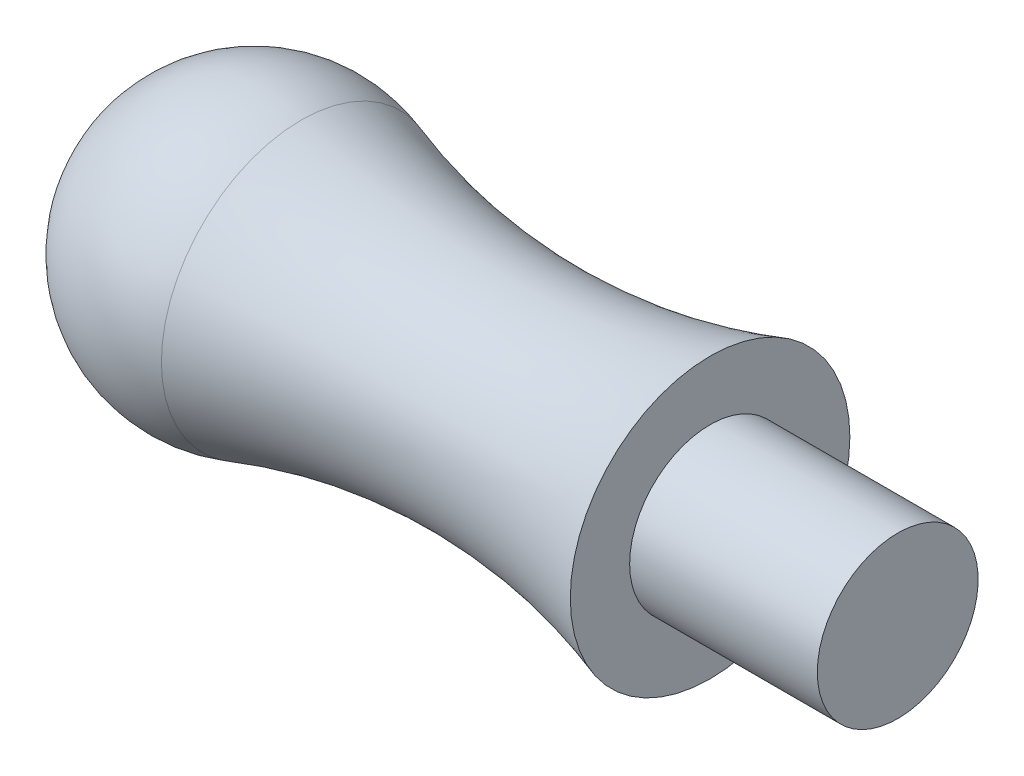
ISO-10303-21;
HEADER;
FILE_DESCRIPTION(('STEP AP214'),'2;1');
FILE_NAME('part.step','',(''),(''),'','','');
FILE_SCHEMA(('AUTOMOTIVE_DESIGN { 1 0 10303 214 1 1 1 1 }'));
ENDSEC;
DATA;
#1=APPLICATION_CONTEXT('core data for automotive mechanical design processes');
#2=APPLICATION_PROTOCOL_DEFINITION('international standard','automotive_design',2000,#1);
#3=PRODUCT_CONTEXT('',#1,'mechanical');
#4=PRODUCT('Part','Part','',(#3));
#5=PRODUCT_RELATED_PRODUCT_CATEGORY('part','',(#4));
#6=PRODUCT_DEFINITION_FORMATION('','',#4);
#7=PRODUCT_DEFINITION_CONTEXT('part definition',#1,'design');
#8=PRODUCT_DEFINITION('design','',#6,#7);
#9=PRODUCT_DEFINITION_SHAPE('','',#8);
#10=(LENGTH_UNIT() NAMED_UNIT(*) SI_UNIT(.MILLI.,.METRE.));
#11=(NAMED_UNIT(*) PLANE_ANGLE_UNIT() SI_UNIT($,.RADIAN.));
#12=(NAMED_UNIT(*) SI_UNIT($,.STERADIAN.) SOLID_ANGLE_UNIT());
#13=UNCERTAINTY_MEASURE_WITH_UNIT(LENGTH_MEASURE(1.E-05),#10,'distance_accuracy_value','');
#14=(GEOMETRIC_REPRESENTATION_CONTEXT(3) GLOBAL_UNCERTAINTY_ASSIGNED_CONTEXT((#13)) GLOBAL_UNIT_ASSIGNED_CONTEXT((#10,
#11,#12)) REPRESENTATION_CONTEXT('',''));
#15=CARTESIAN_POINT('',(0.,0.,0.));
#16=DIRECTION('',(0.,0.,1.));
#17=DIRECTION('',(1.,0.,0.));
#18=AXIS2_PLACEMENT_3D('',#15,#16,#17);
#19=CARTESIAN_POINT('',(0.,0.,0.));
#20=DIRECTION('',(-1.,0.,0.));
#21=DIRECTION('',(0.,1.,0.));
#22=AXIS2_PLACEMENT_3D('',#19,#20,#21);
#23=SPHERICAL_SURFACE('',#22,5.5);
#24=CARTESIAN_POINT('',(1.74766355140187,0.,0.));
#25=DIRECTION('',(-1.,0.,0.));
#26=DIRECTION('',(0.,0.,1.));
#27=AXIS2_PLACEMENT_3D('',#24,#25,#26);
#28=CIRCLE('',#27,5.21494699024845);
#29=CARTESIAN_POINT('',(1.74766355140187,0.,5.21494699024845));
#30=VERTEX_POINT('',#29);
#31=EDGE_CURVE('E48',#30,#30,#28,.T.);
#32=ORIENTED_EDGE('',*,*,#31,.T.);
#33=EDGE_LOOP('',(#32));
#34=FACE_BOUND('',#33,.T.);
#35=ADVANCED_FACE('F34',(#34),#23,.T.);
#36=CARTESIAN_POINT('',(24.,0.,0.));
#37=DIRECTION('',(-1.,0.,0.));
#38=DIRECTION('',(0.,0.,1.));
#39=AXIS2_PLACEMENT_3D('',#36,#37,#38);
#40=PLANE('',#39);
#41=CARTESIAN_POINT('',(24.,0.,0.));
#42=DIRECTION('',(-1.,0.,0.));
#43=DIRECTION('',(0.,0.,1.));
#44=AXIS2_PLACEMENT_3D('',#41,#42,#43);
#45=CIRCLE('',#44,3.);
#46=CARTESIAN_POINT('',(24.,0.,3.));
#47=VERTEX_POINT('',#46);
#48=EDGE_CURVE('E10',#47,#47,#45,.T.);
#49=ORIENTED_EDGE('',*,*,#48,.F.);
#50=EDGE_LOOP('',(#49));
#51=FACE_BOUND('',#50,.T.);
#52=ADVANCED_FACE('F68',(#51),#40,.F.);
#53=CARTESIAN_POINT('',(0.,0.,0.));
#54=DIRECTION('',(-1.,0.,0.));
#55=DIRECTION('',(0.,0.,1.));
#56=AXIS2_PLACEMENT_3D('',#53,#54,#55);
#57=CYLINDRICAL_SURFACE('',#56,3.);
#58=CARTESIAN_POINT('',(17.,0.,0.));
#59=DIRECTION('',(-1.,0.,0.));
#60=DIRECTION('',(0.,0.,1.));
#61=AXIS2_PLACEMENT_3D('',#58,#59,#60);
#62=CIRCLE('',#61,3.);
#63=CARTESIAN_POINT('',(17.,0.,3.));
#64=VERTEX_POINT('',#63);
#65=EDGE_CURVE('E40',#64,#64,#62,.T.);
#66=ORIENTED_EDGE('',*,*,#65,.F.);
#67=EDGE_LOOP('',(#66));
#68=FACE_BOUND('',#67,.T.);
#69=ORIENTED_EDGE('',*,*,#48,.T.);
#70=EDGE_LOOP('',(#69));
#71=FACE_BOUND('',#70,.T.);
#72=ADVANCED_FACE('F63',(#68,#71),#57,.T.);
#73=CARTESIAN_POINT('',(17.,3.,0.));
#74=DIRECTION('',(-1.,0.,0.));
#75=DIRECTION('',(0.,0.,1.));
#76=AXIS2_PLACEMENT_3D('',#73,#74,#75);
#77=PLANE('',#76);
#78=CARTESIAN_POINT('',(17.,0.,0.));
#79=DIRECTION('',(-1.,0.,0.));
#80=DIRECTION('',(0.,0.,1.));
#81=AXIS2_PLACEMENT_3D('',#78,#79,#80);
#82=CIRCLE('',#81,5.21494699024845);
#83=CARTESIAN_POINT('',(17.,0.,5.21494699024845));
#84=VERTEX_POINT('',#83);
#85=EDGE_CURVE('E44',#84,#84,#82,.T.);
#86=ORIENTED_EDGE('',*,*,#85,.F.);
#87=EDGE_LOOP('',(#86));
#88=FACE_BOUND('',#87,.T.);
#89=ORIENTED_EDGE('',*,*,#65,.T.);
#90=EDGE_LOOP('',(#89));
#91=FACE_BOUND('',#90,.T.);
#92=ADVANCED_FACE('F58',(#88,#91),#77,.F.);
#93=CARTESIAN_POINT('',(9.37383177570093,0.,0.));
#94=DIRECTION('',(-1.,0.,0.));
#95=DIRECTION('',(0.,0.,1.));
#96=AXIS2_PLACEMENT_3D('',#93,#94,#95);
#97=TOROIDAL_SURFACE('',#96,27.9710793113326,24.);
#98=ORIENTED_EDGE('',*,*,#31,.F.);
#99=EDGE_LOOP('',(#98));
#100=FACE_BOUND('',#99,.T.);
#101=ORIENTED_EDGE('',*,*,#85,.T.);
#102=EDGE_LOOP('',(#101));
#103=FACE_BOUND('',#102,.T.);
#104=ADVANCED_FACE('F55',(#100,#103),#97,.F.);
#105=CLOSED_SHELL('',(#35,#52,#72,#92,#104));
#106=MANIFOLD_SOLID_BREP('B2',#105);
#107=ADVANCED_BREP_SHAPE_REPRESENTATION('',(#18,#106),#14);
#108=SHAPE_DEFINITION_REPRESENTATION(#9,#107);
ENDSEC;
END-ISO-10303-21;
